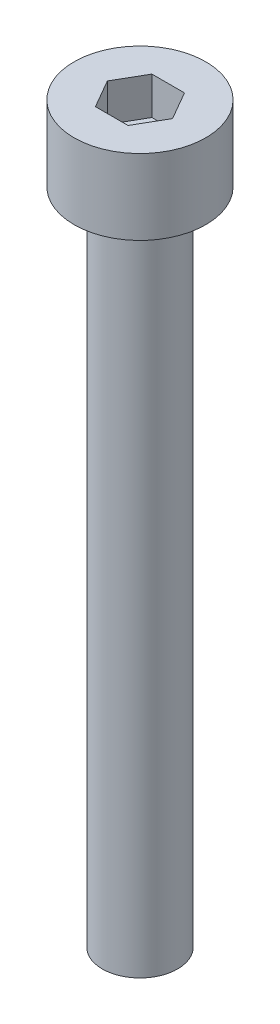
ISO-10303-21;
HEADER;
FILE_DESCRIPTION(('STEP AP214'),'2;1');
FILE_NAME('part.step','',(''),(''),'','','');
FILE_SCHEMA(('AUTOMOTIVE_DESIGN { 1 0 10303 214 1 1 1 1 }'));
ENDSEC;
DATA;
#1=APPLICATION_CONTEXT('core data for automotive mechanical design processes');
#2=APPLICATION_PROTOCOL_DEFINITION('international standard','automotive_design',2000,#1);
#3=PRODUCT_CONTEXT('',#1,'mechanical');
#4=PRODUCT('Part','Part','',(#3));
#5=PRODUCT_RELATED_PRODUCT_CATEGORY('part','',(#4));
#6=PRODUCT_DEFINITION_FORMATION('','',#4);
#7=PRODUCT_DEFINITION_CONTEXT('part definition',#1,'design');
#8=PRODUCT_DEFINITION('design','',#6,#7);
#9=PRODUCT_DEFINITION_SHAPE('','',#8);
#10=(LENGTH_UNIT() NAMED_UNIT(*) SI_UNIT(.MILLI.,.METRE.));
#11=(NAMED_UNIT(*) PLANE_ANGLE_UNIT() SI_UNIT($,.RADIAN.));
#12=(NAMED_UNIT(*) SI_UNIT($,.STERADIAN.) SOLID_ANGLE_UNIT());
#13=UNCERTAINTY_MEASURE_WITH_UNIT(LENGTH_MEASURE(1.E-05),#10,'distance_accuracy_value','');
#14=(GEOMETRIC_REPRESENTATION_CONTEXT(3) GLOBAL_UNCERTAINTY_ASSIGNED_CONTEXT((#13)) GLOBAL_UNIT_ASSIGNED_CONTEXT((#10,
#11,#12)) REPRESENTATION_CONTEXT('',''));
#15=CARTESIAN_POINT('',(0.,0.,0.));
#16=DIRECTION('',(0.,0.,1.));
#17=DIRECTION('',(1.,0.,0.));
#18=AXIS2_PLACEMENT_3D('',#15,#16,#17);
#19=CARTESIAN_POINT('',(0.,4.,0.));
#20=DIRECTION('',(0.,-1.,0.));
#21=DIRECTION('',(0.,0.,-1.));
#22=AXIS2_PLACEMENT_3D('',#19,#20,#21);
#23=CYLINDRICAL_SURFACE('',#22,3.5);
#24=CARTESIAN_POINT('',(0.,4.,0.));
#25=DIRECTION('',(0.,1.,0.));
#26=DIRECTION('',(0.,0.,1.));
#27=AXIS2_PLACEMENT_3D('',#24,#25,#26);
#28=CIRCLE('',#27,3.5);
#29=CARTESIAN_POINT('',(0.,4.,3.5));
#30=VERTEX_POINT('',#29);
#31=EDGE_CURVE('E11',#30,#30,#28,.T.);
#32=ORIENTED_EDGE('',*,*,#31,.F.);
#33=EDGE_LOOP('',(#32));
#34=FACE_BOUND('',#33,.T.);
#35=CARTESIAN_POINT('',(0.,0.,0.));
#36=DIRECTION('',(0.,1.,0.));
#37=DIRECTION('',(0.,0.,1.));
#38=AXIS2_PLACEMENT_3D('',#35,#36,#37);
#39=CIRCLE('',#38,3.5);
#40=CARTESIAN_POINT('',(0.,0.,3.5));
#41=VERTEX_POINT('',#40);
#42=EDGE_CURVE('E41',#41,#41,#39,.T.);
#43=ORIENTED_EDGE('',*,*,#42,.T.);
#44=EDGE_LOOP('',(#43));
#45=FACE_BOUND('',#44,.T.);
#46=ADVANCED_FACE('F38',(#34,#45),#23,.T.);
#47=CARTESIAN_POINT('',(0.,4.,0.));
#48=DIRECTION('',(0.,1.,0.));
#49=DIRECTION('',(0.,0.,1.));
#50=AXIS2_PLACEMENT_3D('',#47,#48,#49);
#51=PLANE('',#50);
#52=DIRECTION('',(0.5,0.,-0.866025403784439));
#53=VECTOR('',#52,1.);
#54=CARTESIAN_POINT('',(0.866025403784438,4.,1.5));
#55=LINE('',#54,#53);
#56=CARTESIAN_POINT('',(0.866025403784438,4.,1.5));
#57=VERTEX_POINT('',#56);
#58=CARTESIAN_POINT('',(1.73205080756888,4.,0.));
#59=VERTEX_POINT('',#58);
#60=EDGE_CURVE('E52',#57,#59,#55,.T.);
#61=ORIENTED_EDGE('',*,*,#60,.F.);
#62=DIRECTION('',(1.,0.,0.));
#63=VECTOR('',#62,1.);
#64=CARTESIAN_POINT('',(-0.866025403784438,4.,1.5));
#65=LINE('',#64,#63);
#66=CARTESIAN_POINT('',(-0.866025403784438,4.,1.5));
#67=VERTEX_POINT('',#66);
#68=EDGE_CURVE('E135',#67,#57,#65,.T.);
#69=ORIENTED_EDGE('',*,*,#68,.F.);
#70=DIRECTION('',(0.5,0.,0.866025403784438));
#71=VECTOR('',#70,1.);
#72=CARTESIAN_POINT('',(-1.73205080756888,4.,0.));
#73=LINE('',#72,#71);
#74=CARTESIAN_POINT('',(-1.73205080756888,4.,0.));
#75=VERTEX_POINT('',#74);
#76=EDGE_CURVE('E133',#75,#67,#73,.T.);
#77=ORIENTED_EDGE('',*,*,#76,.F.);
#78=DIRECTION('',(-0.5,0.,0.866025403784439));
#79=VECTOR('',#78,1.);
#80=CARTESIAN_POINT('',(-0.866025403784439,4.,-1.5));
#81=LINE('',#80,#79);
#82=CARTESIAN_POINT('',(-0.866025403784439,4.,-1.5));
#83=VERTEX_POINT('',#82);
#84=EDGE_CURVE('E100',#83,#75,#81,.T.);
#85=ORIENTED_EDGE('',*,*,#84,.F.);
#86=DIRECTION('',(-1.,0.,0.));
#87=VECTOR('',#86,1.);
#88=CARTESIAN_POINT('',(0.866025403784438,4.,-1.5));
#89=LINE('',#88,#87);
#90=CARTESIAN_POINT('',(0.866025403784438,4.,-1.5));
#91=VERTEX_POINT('',#90);
#92=EDGE_CURVE('E129',#91,#83,#89,.T.);
#93=ORIENTED_EDGE('',*,*,#92,.F.);
#94=DIRECTION('',(-0.5,0.,-0.866025403784439));
#95=VECTOR('',#94,1.);
#96=CARTESIAN_POINT('',(1.73205080756888,4.,0.));
#97=LINE('',#96,#95);
#98=EDGE_CURVE('E126',#59,#91,#97,.T.);
#99=ORIENTED_EDGE('',*,*,#98,.F.);
#100=EDGE_LOOP('',(#61,#69,#77,#85,#93,#99));
#101=FACE_BOUND('',#100,.T.);
#102=ORIENTED_EDGE('',*,*,#31,.T.);
#103=EDGE_LOOP('',(#102));
#104=FACE_BOUND('',#103,.T.);
#105=ADVANCED_FACE('F166',(#101,#104),#51,.T.);
#106=CARTESIAN_POINT('',(0.,0.,0.));
#107=DIRECTION('',(0.,1.,0.));
#108=DIRECTION('',(0.,0.,1.));
#109=AXIS2_PLACEMENT_3D('',#106,#107,#108);
#110=PLANE('',#109);
#111=CARTESIAN_POINT('',(0.,0.,0.));
#112=DIRECTION('',(0.,1.,0.));
#113=DIRECTION('',(0.,0.,1.));
#114=AXIS2_PLACEMENT_3D('',#111,#112,#113);
#115=CIRCLE('',#114,2.);
#116=CARTESIAN_POINT('',(0.,0.,2.));
#117=VERTEX_POINT('',#116);
#118=EDGE_CURVE('E139',#117,#117,#115,.T.);
#119=ORIENTED_EDGE('',*,*,#118,.T.);
#120=EDGE_LOOP('',(#119));
#121=FACE_BOUND('',#120,.T.);
#122=ORIENTED_EDGE('',*,*,#42,.F.);
#123=EDGE_LOOP('',(#122));
#124=FACE_BOUND('',#123,.T.);
#125=ADVANCED_FACE('F151',(#121,#124),#110,.F.);
#126=CARTESIAN_POINT('',(0.,-35.,0.));
#127=DIRECTION('',(0.,1.,0.));
#128=DIRECTION('',(0.,0.,1.));
#129=AXIS2_PLACEMENT_3D('',#126,#127,#128);
#130=CYLINDRICAL_SURFACE('',#129,2.);
#131=CARTESIAN_POINT('',(0.,-35.,0.));
#132=DIRECTION('',(0.,1.,0.));
#133=DIRECTION('',(0.,0.,1.));
#134=AXIS2_PLACEMENT_3D('',#131,#132,#133);
#135=CIRCLE('',#134,2.);
#136=CARTESIAN_POINT('',(0.,-35.,2.));
#137=VERTEX_POINT('',#136);
#138=EDGE_CURVE('E145',#137,#137,#135,.T.);
#139=ORIENTED_EDGE('',*,*,#138,.T.);
#140=EDGE_LOOP('',(#139));
#141=FACE_BOUND('',#140,.T.);
#142=ORIENTED_EDGE('',*,*,#118,.F.);
#143=EDGE_LOOP('',(#142));
#144=FACE_BOUND('',#143,.T.);
#145=ADVANCED_FACE('F154',(#141,#144),#130,.T.);
#146=CARTESIAN_POINT('',(0.,-35.,0.));
#147=DIRECTION('',(0.,1.,0.));
#148=DIRECTION('',(0.,0.,1.));
#149=AXIS2_PLACEMENT_3D('',#146,#147,#148);
#150=PLANE('',#149);
#151=ORIENTED_EDGE('',*,*,#138,.F.);
#152=EDGE_LOOP('',(#151));
#153=FACE_BOUND('',#152,.T.);
#154=ADVANCED_FACE('F156',(#153),#150,.F.);
#155=CARTESIAN_POINT('',(0.866025403784438,2.,1.5));
#156=DIRECTION('',(0.866025403784439,0.,0.5));
#157=DIRECTION('',(0.5,0.,-0.866025403784439));
#158=AXIS2_PLACEMENT_3D('',#155,#156,#157);
#159=PLANE('',#158);
#160=ORIENTED_EDGE('',*,*,#60,.T.);
#161=DIRECTION('',(0.,1.,0.));
#162=VECTOR('',#161,1.);
#163=CARTESIAN_POINT('',(1.73205080756888,2.,0.));
#164=LINE('',#163,#162);
#165=CARTESIAN_POINT('',(1.73205080756888,2.,0.));
#166=VERTEX_POINT('',#165);
#167=EDGE_CURVE('E82',#166,#59,#164,.T.);
#168=ORIENTED_EDGE('',*,*,#167,.F.);
#169=DIRECTION('',(0.5,0.,-0.866025403784439));
#170=VECTOR('',#169,1.);
#171=CARTESIAN_POINT('',(0.866025403784438,2.,1.5));
#172=LINE('',#171,#170);
#173=CARTESIAN_POINT('',(0.866025403784438,2.,1.5));
#174=VERTEX_POINT('',#173);
#175=EDGE_CURVE('E137',#174,#166,#172,.T.);
#176=ORIENTED_EDGE('',*,*,#175,.F.);
#177=DIRECTION('',(0.,1.,0.));
#178=VECTOR('',#177,1.);
#179=CARTESIAN_POINT('',(0.866025403784438,2.,1.5));
#180=LINE('',#179,#178);
#181=EDGE_CURVE('E60',#174,#57,#180,.T.);
#182=ORIENTED_EDGE('',*,*,#181,.T.);
#183=EDGE_LOOP('',(#160,#168,#176,#182));
#184=FACE_BOUND('',#183,.T.);
#185=ADVANCED_FACE('F163',(#184),#159,.F.);
#186=CARTESIAN_POINT('',(-0.866025403784438,2.,1.5));
#187=DIRECTION('',(0.,0.,1.));
#188=DIRECTION('',(1.,0.,0.));
#189=AXIS2_PLACEMENT_3D('',#186,#187,#188);
#190=PLANE('',#189);
#191=ORIENTED_EDGE('',*,*,#68,.T.);
#192=ORIENTED_EDGE('',*,*,#181,.F.);
#193=DIRECTION('',(1.,0.,0.));
#194=VECTOR('',#193,1.);
#195=CARTESIAN_POINT('',(-0.866025403784438,2.,1.5));
#196=LINE('',#195,#194);
#197=CARTESIAN_POINT('',(-0.866025403784438,2.,1.5));
#198=VERTEX_POINT('',#197);
#199=EDGE_CURVE('E112',#198,#174,#196,.T.);
#200=ORIENTED_EDGE('',*,*,#199,.F.);
#201=DIRECTION('',(0.,1.,0.));
#202=VECTOR('',#201,1.);
#203=CARTESIAN_POINT('',(-0.866025403784438,2.,1.5));
#204=LINE('',#203,#202);
#205=EDGE_CURVE('E104',#198,#67,#204,.T.);
#206=ORIENTED_EDGE('',*,*,#205,.T.);
#207=EDGE_LOOP('',(#191,#192,#200,#206));
#208=FACE_BOUND('',#207,.T.);
#209=ADVANCED_FACE('F188',(#208),#190,.F.);
#210=CARTESIAN_POINT('',(-1.73205080756888,2.,0.));
#211=DIRECTION('',(-0.866025403784439,0.,0.5));
#212=DIRECTION('',(0.5,0.,0.866025403784438));
#213=AXIS2_PLACEMENT_3D('',#210,#211,#212);
#214=PLANE('',#213);
#215=ORIENTED_EDGE('',*,*,#76,.T.);
#216=ORIENTED_EDGE('',*,*,#205,.F.);
#217=DIRECTION('',(0.5,0.,0.866025403784438));
#218=VECTOR('',#217,1.);
#219=CARTESIAN_POINT('',(-1.73205080756888,2.,0.));
#220=LINE('',#219,#218);
#221=CARTESIAN_POINT('',(-1.73205080756888,2.,0.));
#222=VERTEX_POINT('',#221);
#223=EDGE_CURVE('E108',#222,#198,#220,.T.);
#224=ORIENTED_EDGE('',*,*,#223,.F.);
#225=DIRECTION('',(0.,1.,0.));
#226=VECTOR('',#225,1.);
#227=CARTESIAN_POINT('',(-1.73205080756888,2.,0.));
#228=LINE('',#227,#226);
#229=EDGE_CURVE('E93',#222,#75,#228,.T.);
#230=ORIENTED_EDGE('',*,*,#229,.T.);
#231=EDGE_LOOP('',(#215,#216,#224,#230));
#232=FACE_BOUND('',#231,.T.);
#233=ADVANCED_FACE('F109',(#232),#214,.F.);
#234=CARTESIAN_POINT('',(-0.866025403784439,2.,-1.5));
#235=DIRECTION('',(-0.866025403784439,0.,-0.5));
#236=DIRECTION('',(-0.5,0.,0.866025403784439));
#237=AXIS2_PLACEMENT_3D('',#234,#235,#236);
#238=PLANE('',#237);
#239=ORIENTED_EDGE('',*,*,#84,.T.);
#240=ORIENTED_EDGE('',*,*,#229,.F.);
#241=DIRECTION('',(-0.5,0.,0.866025403784439));
#242=VECTOR('',#241,1.);
#243=CARTESIAN_POINT('',(-0.866025403784439,2.,-1.5));
#244=LINE('',#243,#242);
#245=CARTESIAN_POINT('',(-0.866025403784439,2.,-1.5));
#246=VERTEX_POINT('',#245);
#247=EDGE_CURVE('E97',#246,#222,#244,.T.);
#248=ORIENTED_EDGE('',*,*,#247,.F.);
#249=DIRECTION('',(0.,1.,0.));
#250=VECTOR('',#249,1.);
#251=CARTESIAN_POINT('',(-0.866025403784439,2.,-1.5));
#252=LINE('',#251,#250);
#253=EDGE_CURVE('E105',#246,#83,#252,.T.);
#254=ORIENTED_EDGE('',*,*,#253,.T.);
#255=EDGE_LOOP('',(#239,#240,#248,#254));
#256=FACE_BOUND('',#255,.T.);
#257=ADVANCED_FACE('F95',(#256),#238,.F.);
#258=CARTESIAN_POINT('',(0.866025403784438,2.,-1.5));
#259=DIRECTION('',(0.,0.,-1.));
#260=DIRECTION('',(-1.,0.,0.));
#261=AXIS2_PLACEMENT_3D('',#258,#259,#260);
#262=PLANE('',#261);
#263=ORIENTED_EDGE('',*,*,#92,.T.);
#264=ORIENTED_EDGE('',*,*,#253,.F.);
#265=DIRECTION('',(-1.,0.,0.));
#266=VECTOR('',#265,1.);
#267=CARTESIAN_POINT('',(0.866025403784438,2.,-1.5));
#268=LINE('',#267,#266);
#269=CARTESIAN_POINT('',(0.866025403784438,2.,-1.5));
#270=VERTEX_POINT('',#269);
#271=EDGE_CURVE('E118',#270,#246,#268,.T.);
#272=ORIENTED_EDGE('',*,*,#271,.F.);
#273=DIRECTION('',(0.,1.,0.));
#274=VECTOR('',#273,1.);
#275=CARTESIAN_POINT('',(0.866025403784438,2.,-1.5));
#276=LINE('',#275,#274);
#277=EDGE_CURVE('E142',#270,#91,#276,.T.);
#278=ORIENTED_EDGE('',*,*,#277,.T.);
#279=EDGE_LOOP('',(#263,#264,#272,#278));
#280=FACE_BOUND('',#279,.T.);
#281=ADVANCED_FACE('F197',(#280),#262,.F.);
#282=CARTESIAN_POINT('',(1.73205080756888,2.,0.));
#283=DIRECTION('',(0.866025403784439,0.,-0.5));
#284=DIRECTION('',(-0.5,0.,-0.866025403784439));
#285=AXIS2_PLACEMENT_3D('',#282,#283,#284);
#286=PLANE('',#285);
#287=ORIENTED_EDGE('',*,*,#98,.T.);
#288=ORIENTED_EDGE('',*,*,#277,.F.);
#289=DIRECTION('',(-0.5,0.,-0.866025403784439));
#290=VECTOR('',#289,1.);
#291=CARTESIAN_POINT('',(1.73205080756888,2.,0.));
#292=LINE('',#291,#290);
#293=EDGE_CURVE('E120',#166,#270,#292,.T.);
#294=ORIENTED_EDGE('',*,*,#293,.F.);
#295=ORIENTED_EDGE('',*,*,#167,.T.);
#296=EDGE_LOOP('',(#287,#288,#294,#295));
#297=FACE_BOUND('',#296,.T.);
#298=ADVANCED_FACE('F185',(#297),#286,.F.);
#299=CARTESIAN_POINT('',(0.,2.,0.));
#300=DIRECTION('',(0.,1.,0.));
#301=DIRECTION('',(0.,0.,1.));
#302=AXIS2_PLACEMENT_3D('',#299,#300,#301);
#303=PLANE('',#302);
#304=ORIENTED_EDGE('',*,*,#175,.T.);
#305=ORIENTED_EDGE('',*,*,#293,.T.);
#306=ORIENTED_EDGE('',*,*,#271,.T.);
#307=ORIENTED_EDGE('',*,*,#247,.T.);
#308=ORIENTED_EDGE('',*,*,#223,.T.);
#309=ORIENTED_EDGE('',*,*,#199,.T.);
#310=EDGE_LOOP('',(#304,#305,#306,#307,#308,#309));
#311=FACE_BOUND('',#310,.T.);
#312=ADVANCED_FACE('F115',(#311),#303,.T.);
#313=CLOSED_SHELL('',(#46,#105,#125,#145,#154,#185,#209,#233,#257,#281,#298,#312));
#314=MANIFOLD_SOLID_BREP('B2',#313);
#315=ADVANCED_BREP_SHAPE_REPRESENTATION('',(#18,#314),#14);
#316=SHAPE_DEFINITION_REPRESENTATION(#9,#315);
ENDSEC;
END-ISO-10303-21;
